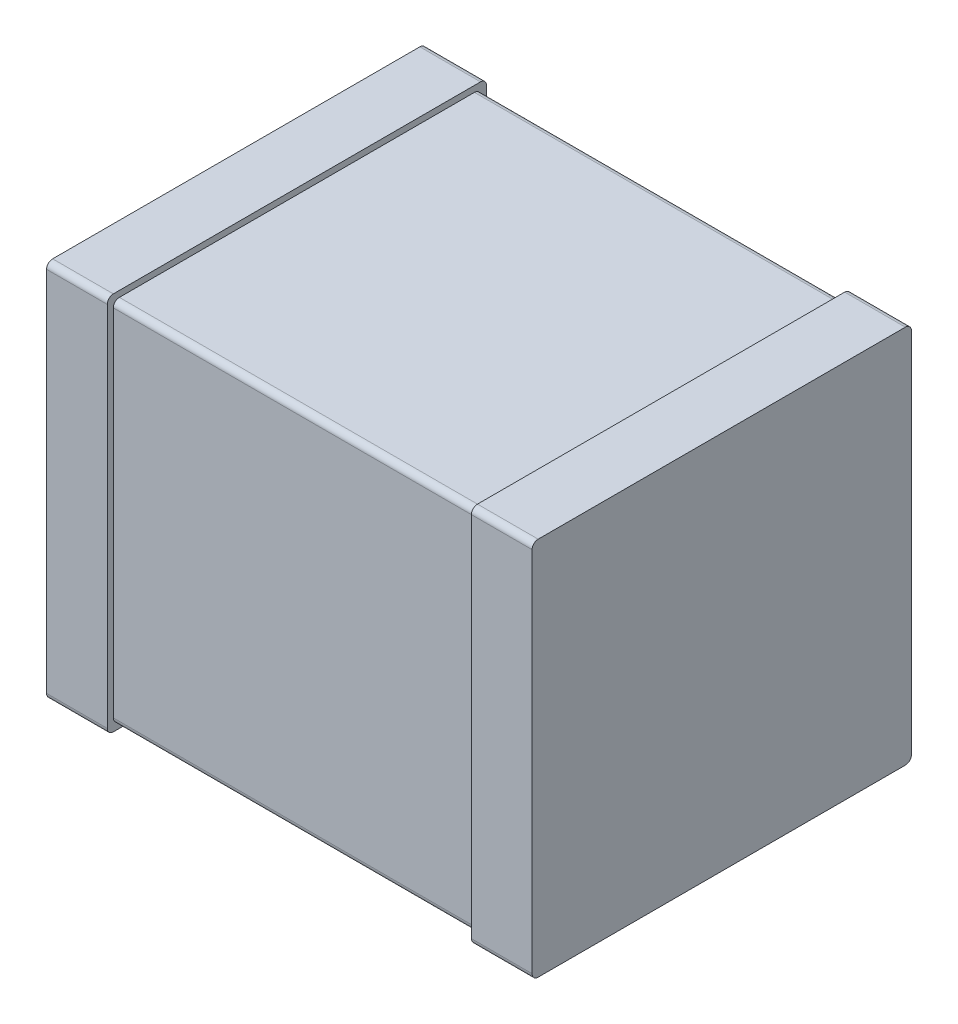
ISO-10303-21;
HEADER;
FILE_DESCRIPTION(('STEP AP214'),'2;1');
FILE_NAME('part.step','',(''),(''),'','','');
FILE_SCHEMA(('AUTOMOTIVE_DESIGN { 1 0 10303 214 1 1 1 1 }'));
ENDSEC;
DATA;
#1=APPLICATION_CONTEXT('core data for automotive mechanical design processes');
#2=APPLICATION_PROTOCOL_DEFINITION('international standard','automotive_design',2000,#1);
#3=PRODUCT_CONTEXT('',#1,'mechanical');
#4=PRODUCT('Part','Part','',(#3));
#5=PRODUCT_RELATED_PRODUCT_CATEGORY('part','',(#4));
#6=PRODUCT_DEFINITION_FORMATION('','',#4);
#7=PRODUCT_DEFINITION_CONTEXT('part definition',#1,'design');
#8=PRODUCT_DEFINITION('design','',#6,#7);
#9=PRODUCT_DEFINITION_SHAPE('','',#8);
#10=(LENGTH_UNIT() NAMED_UNIT(*) SI_UNIT(.MILLI.,.METRE.));
#11=(NAMED_UNIT(*) PLANE_ANGLE_UNIT() SI_UNIT($,.RADIAN.));
#12=(NAMED_UNIT(*) SI_UNIT($,.STERADIAN.) SOLID_ANGLE_UNIT());
#13=UNCERTAINTY_MEASURE_WITH_UNIT(LENGTH_MEASURE(1.E-05),#10,'distance_accuracy_value','');
#14=(GEOMETRIC_REPRESENTATION_CONTEXT(3) GLOBAL_UNCERTAINTY_ASSIGNED_CONTEXT((#13)) GLOBAL_UNIT_ASSIGNED_CONTEXT((#10,
#11,#12)) REPRESENTATION_CONTEXT('',''));
#15=CARTESIAN_POINT('',(0.,0.,0.));
#16=DIRECTION('',(0.,0.,1.));
#17=DIRECTION('',(1.,0.,0.));
#18=AXIS2_PLACEMENT_3D('',#15,#16,#17);
#19=CARTESIAN_POINT('',(1.6,-1.25,0.));
#20=DIRECTION('',(1.,0.,0.));
#21=DIRECTION('',(0.,1.,0.));
#22=AXIS2_PLACEMENT_3D('',#19,#20,#21);
#23=PLANE('',#22);
#24=DIRECTION('',(0.,0.,1.));
#25=VECTOR('',#24,1.);
#26=CARTESIAN_POINT('',(1.6,-1.25,0.));
#27=LINE('',#26,#25);
#28=CARTESIAN_POINT('',(1.6,-1.25,0.04));
#29=VERTEX_POINT('',#28);
#30=CARTESIAN_POINT('',(1.6,-1.25,2.46));
#31=VERTEX_POINT('',#30);
#32=EDGE_CURVE('E385',#29,#31,#27,.T.);
#33=ORIENTED_EDGE('',*,*,#32,.F.);
#34=CARTESIAN_POINT('',(1.6,-1.21,0.04));
#35=DIRECTION('',(1.,0.,0.));
#36=DIRECTION('',(0.,0.,1.));
#37=AXIS2_PLACEMENT_3D('',#34,#35,#36);
#38=CIRCLE('',#37,0.04);
#39=CARTESIAN_POINT('',(1.6,-1.21,0.));
#40=VERTEX_POINT('',#39);
#41=EDGE_CURVE('E483',#29,#40,#38,.T.);
#42=ORIENTED_EDGE('',*,*,#41,.T.);
#43=DIRECTION('',(0.,1.,0.));
#44=VECTOR('',#43,1.);
#45=CARTESIAN_POINT('',(1.6,-1.25,0.));
#46=LINE('',#45,#44);
#47=CARTESIAN_POINT('',(1.6,1.21,0.));
#48=VERTEX_POINT('',#47);
#49=EDGE_CURVE('E492',#40,#48,#46,.T.);
#50=ORIENTED_EDGE('',*,*,#49,.T.);
#51=CARTESIAN_POINT('',(1.6,1.21,0.04));
#52=DIRECTION('',(-1.,0.,0.));
#53=DIRECTION('',(0.,0.,1.));
#54=AXIS2_PLACEMENT_3D('',#51,#52,#53);
#55=CIRCLE('',#54,0.04);
#56=CARTESIAN_POINT('',(1.6,1.25,0.04));
#57=VERTEX_POINT('',#56);
#58=EDGE_CURVE('E20',#57,#48,#55,.T.);
#59=ORIENTED_EDGE('',*,*,#58,.F.);
#60=DIRECTION('',(0.,0.,1.));
#61=VECTOR('',#60,1.);
#62=CARTESIAN_POINT('',(1.6,1.25,0.));
#63=LINE('',#62,#61);
#64=CARTESIAN_POINT('',(1.6,1.25,2.46));
#65=VERTEX_POINT('',#64);
#66=EDGE_CURVE('E11',#57,#65,#63,.T.);
#67=ORIENTED_EDGE('',*,*,#66,.T.);
#68=CARTESIAN_POINT('',(1.6,1.21,2.46));
#69=DIRECTION('',(1.,0.,0.));
#70=DIRECTION('',(0.,0.,1.));
#71=AXIS2_PLACEMENT_3D('',#68,#69,#70);
#72=CIRCLE('',#71,0.04);
#73=CARTESIAN_POINT('',(1.6,1.21,2.5));
#74=VERTEX_POINT('',#73);
#75=EDGE_CURVE('E284',#65,#74,#72,.T.);
#76=ORIENTED_EDGE('',*,*,#75,.T.);
#77=DIRECTION('',(0.,1.,0.));
#78=VECTOR('',#77,1.);
#79=CARTESIAN_POINT('',(1.6,-1.25,2.5));
#80=LINE('',#79,#78);
#81=CARTESIAN_POINT('',(1.6,-1.21,2.5));
#82=VERTEX_POINT('',#81);
#83=EDGE_CURVE('E353',#82,#74,#80,.T.);
#84=ORIENTED_EDGE('',*,*,#83,.F.);
#85=CARTESIAN_POINT('',(1.6,-1.21,2.46));
#86=DIRECTION('',(-1.,0.,0.));
#87=DIRECTION('',(0.,0.,1.));
#88=AXIS2_PLACEMENT_3D('',#85,#86,#87);
#89=CIRCLE('',#88,0.04);
#90=EDGE_CURVE('E487',#31,#82,#89,.T.);
#91=ORIENTED_EDGE('',*,*,#90,.F.);
#92=EDGE_LOOP('',(#33,#42,#50,#59,#67,#76,#84,#91));
#93=FACE_BOUND('',#92,.T.);
#94=ADVANCED_FACE('F17',(#93),#23,.T.);
#95=CARTESIAN_POINT('',(1.2,1.25,0.));
#96=DIRECTION('',(0.,1.,0.));
#97=DIRECTION('',(1.,0.,0.));
#98=AXIS2_PLACEMENT_3D('',#95,#96,#97);
#99=PLANE('',#98);
#100=ORIENTED_EDGE('',*,*,#66,.F.);
#101=DIRECTION('',(1.,0.,0.));
#102=VECTOR('',#101,1.);
#103=CARTESIAN_POINT('',(1.2,1.25,0.04));
#104=LINE('',#103,#102);
#105=CARTESIAN_POINT('',(1.2,1.25,0.04));
#106=VERTEX_POINT('',#105);
#107=EDGE_CURVE('E352',#106,#57,#104,.T.);
#108=ORIENTED_EDGE('',*,*,#107,.F.);
#109=DIRECTION('',(0.,0.,1.));
#110=VECTOR('',#109,1.);
#111=CARTESIAN_POINT('',(1.2,1.25,0.));
#112=LINE('',#111,#110);
#113=CARTESIAN_POINT('',(1.2,1.25,2.46));
#114=VERTEX_POINT('',#113);
#115=EDGE_CURVE('E396',#106,#114,#112,.T.);
#116=ORIENTED_EDGE('',*,*,#115,.T.);
#117=DIRECTION('',(1.,0.,0.));
#118=VECTOR('',#117,1.);
#119=CARTESIAN_POINT('',(1.2,1.25,2.46));
#120=LINE('',#119,#118);
#121=EDGE_CURVE('E26',#114,#65,#120,.T.);
#122=ORIENTED_EDGE('',*,*,#121,.T.);
#123=EDGE_LOOP('',(#100,#108,#116,#122));
#124=FACE_BOUND('',#123,.T.);
#125=ADVANCED_FACE('F523',(#124),#99,.T.);
#126=CARTESIAN_POINT('',(1.2,1.21,2.46));
#127=DIRECTION('',(1.,0.,0.));
#128=DIRECTION('',(0.,1.,0.));
#129=AXIS2_PLACEMENT_3D('',#126,#127,#128);
#130=CYLINDRICAL_SURFACE('',#129,0.04);
#131=CARTESIAN_POINT('',(1.2,1.21,2.46));
#132=DIRECTION('',(1.,0.,0.));
#133=DIRECTION('',(0.,0.,1.));
#134=AXIS2_PLACEMENT_3D('',#131,#132,#133);
#135=CIRCLE('',#134,0.04);
#136=CARTESIAN_POINT('',(1.2,1.21,2.5));
#137=VERTEX_POINT('',#136);
#138=EDGE_CURVE('E461',#114,#137,#135,.T.);
#139=ORIENTED_EDGE('',*,*,#138,.T.);
#140=DIRECTION('',(1.,0.,0.));
#141=VECTOR('',#140,1.);
#142=CARTESIAN_POINT('',(1.2,1.21,2.5));
#143=LINE('',#142,#141);
#144=EDGE_CURVE('E348',#137,#74,#143,.T.);
#145=ORIENTED_EDGE('',*,*,#144,.T.);
#146=ORIENTED_EDGE('',*,*,#75,.F.);
#147=ORIENTED_EDGE('',*,*,#121,.F.);
#148=EDGE_LOOP('',(#139,#145,#146,#147));
#149=FACE_BOUND('',#148,.T.);
#150=ADVANCED_FACE('F526',(#149),#130,.T.);
#151=CARTESIAN_POINT('',(1.2,1.21,0.04));
#152=DIRECTION('',(1.,0.,0.));
#153=DIRECTION('',(0.,1.,0.));
#154=AXIS2_PLACEMENT_3D('',#151,#152,#153);
#155=CYLINDRICAL_SURFACE('',#154,0.04);
#156=ORIENTED_EDGE('',*,*,#107,.T.);
#157=ORIENTED_EDGE('',*,*,#58,.T.);
#158=DIRECTION('',(1.,0.,0.));
#159=VECTOR('',#158,1.);
#160=CARTESIAN_POINT('',(1.2,1.21,0.));
#161=LINE('',#160,#159);
#162=CARTESIAN_POINT('',(1.2,1.21,0.));
#163=VERTEX_POINT('',#162);
#164=EDGE_CURVE('E496',#163,#48,#161,.T.);
#165=ORIENTED_EDGE('',*,*,#164,.F.);
#166=CARTESIAN_POINT('',(1.2,1.21,0.04));
#167=DIRECTION('',(-1.,0.,0.));
#168=DIRECTION('',(0.,0.,1.));
#169=AXIS2_PLACEMENT_3D('',#166,#167,#168);
#170=CIRCLE('',#169,0.04);
#171=EDGE_CURVE('E391',#106,#163,#170,.T.);
#172=ORIENTED_EDGE('',*,*,#171,.F.);
#173=EDGE_LOOP('',(#156,#157,#165,#172));
#174=FACE_BOUND('',#173,.T.);
#175=ADVANCED_FACE('F513',(#174),#155,.T.);
#176=CARTESIAN_POINT('',(1.2,-1.25,2.5));
#177=DIRECTION('',(0.,0.,1.));
#178=DIRECTION('',(1.,0.,0.));
#179=AXIS2_PLACEMENT_3D('',#176,#177,#178);
#180=PLANE('',#179);
#181=DIRECTION('',(0.,1.,0.));
#182=VECTOR('',#181,1.);
#183=CARTESIAN_POINT('',(1.2,-1.25,2.5));
#184=LINE('',#183,#182);
#185=CARTESIAN_POINT('',(1.2,-1.21,2.5));
#186=VERTEX_POINT('',#185);
#187=EDGE_CURVE('E439',#186,#137,#184,.T.);
#188=ORIENTED_EDGE('',*,*,#187,.F.);
#189=DIRECTION('',(1.,0.,0.));
#190=VECTOR('',#189,1.);
#191=CARTESIAN_POINT('',(1.2,-1.21,2.5));
#192=LINE('',#191,#190);
#193=EDGE_CURVE('E491',#186,#82,#192,.T.);
#194=ORIENTED_EDGE('',*,*,#193,.T.);
#195=ORIENTED_EDGE('',*,*,#83,.T.);
#196=ORIENTED_EDGE('',*,*,#144,.F.);
#197=EDGE_LOOP('',(#188,#194,#195,#196));
#198=FACE_BOUND('',#197,.T.);
#199=ADVANCED_FACE('F529',(#198),#180,.T.);
#200=CARTESIAN_POINT('',(1.2,-1.25,0.));
#201=DIRECTION('',(0.,0.,1.));
#202=DIRECTION('',(1.,0.,0.));
#203=AXIS2_PLACEMENT_3D('',#200,#201,#202);
#204=PLANE('',#203);
#205=ORIENTED_EDGE('',*,*,#164,.T.);
#206=ORIENTED_EDGE('',*,*,#49,.F.);
#207=DIRECTION('',(1.,0.,0.));
#208=VECTOR('',#207,1.);
#209=CARTESIAN_POINT('',(1.2,-1.21,0.));
#210=LINE('',#209,#208);
#211=CARTESIAN_POINT('',(1.2,-1.21,0.));
#212=VERTEX_POINT('',#211);
#213=EDGE_CURVE('E389',#212,#40,#210,.T.);
#214=ORIENTED_EDGE('',*,*,#213,.F.);
#215=DIRECTION('',(0.,1.,0.));
#216=VECTOR('',#215,1.);
#217=CARTESIAN_POINT('',(1.2,-1.25,0.));
#218=LINE('',#217,#216);
#219=EDGE_CURVE('E395',#212,#163,#218,.T.);
#220=ORIENTED_EDGE('',*,*,#219,.T.);
#221=EDGE_LOOP('',(#205,#206,#214,#220));
#222=FACE_BOUND('',#221,.T.);
#223=ADVANCED_FACE('F516',(#222),#204,.F.);
#224=CARTESIAN_POINT('',(1.2,-1.21,2.46));
#225=DIRECTION('',(1.,0.,0.));
#226=DIRECTION('',(0.,-1.,0.));
#227=AXIS2_PLACEMENT_3D('',#224,#225,#226);
#228=CYLINDRICAL_SURFACE('',#227,0.04);
#229=DIRECTION('',(1.,0.,0.));
#230=VECTOR('',#229,1.);
#231=CARTESIAN_POINT('',(1.2,-1.25,2.46));
#232=LINE('',#231,#230);
#233=CARTESIAN_POINT('',(1.2,-1.25,2.46));
#234=VERTEX_POINT('',#233);
#235=EDGE_CURVE('E430',#234,#31,#232,.T.);
#236=ORIENTED_EDGE('',*,*,#235,.T.);
#237=ORIENTED_EDGE('',*,*,#90,.T.);
#238=ORIENTED_EDGE('',*,*,#193,.F.);
#239=CARTESIAN_POINT('',(1.2,-1.21,2.46));
#240=DIRECTION('',(-1.,0.,0.));
#241=DIRECTION('',(0.,0.,1.));
#242=AXIS2_PLACEMENT_3D('',#239,#240,#241);
#243=CIRCLE('',#242,0.04);
#244=EDGE_CURVE('E435',#234,#186,#243,.T.);
#245=ORIENTED_EDGE('',*,*,#244,.F.);
#246=EDGE_LOOP('',(#236,#237,#238,#245));
#247=FACE_BOUND('',#246,.T.);
#248=ADVANCED_FACE('F532',(#247),#228,.T.);
#249=CARTESIAN_POINT('',(1.2,-1.21,0.04));
#250=DIRECTION('',(1.,0.,0.));
#251=DIRECTION('',(0.,-1.,0.));
#252=AXIS2_PLACEMENT_3D('',#249,#250,#251);
#253=CYLINDRICAL_SURFACE('',#252,0.04);
#254=CARTESIAN_POINT('',(1.2,-1.21,0.04));
#255=DIRECTION('',(1.,0.,0.));
#256=DIRECTION('',(0.,0.,1.));
#257=AXIS2_PLACEMENT_3D('',#254,#255,#256);
#258=CIRCLE('',#257,0.04);
#259=CARTESIAN_POINT('',(1.2,-1.25,0.04));
#260=VERTEX_POINT('',#259);
#261=EDGE_CURVE('E431',#260,#212,#258,.T.);
#262=ORIENTED_EDGE('',*,*,#261,.T.);
#263=ORIENTED_EDGE('',*,*,#213,.T.);
#264=ORIENTED_EDGE('',*,*,#41,.F.);
#265=DIRECTION('',(1.,0.,0.));
#266=VECTOR('',#265,1.);
#267=CARTESIAN_POINT('',(1.2,-1.25,0.04));
#268=LINE('',#267,#266);
#269=EDGE_CURVE('E390',#260,#29,#268,.T.);
#270=ORIENTED_EDGE('',*,*,#269,.F.);
#271=EDGE_LOOP('',(#262,#263,#264,#270));
#272=FACE_BOUND('',#271,.T.);
#273=ADVANCED_FACE('F537',(#272),#253,.T.);
#274=CARTESIAN_POINT('',(1.2,-1.25,0.));
#275=DIRECTION('',(0.,1.,0.));
#276=DIRECTION('',(1.,0.,0.));
#277=AXIS2_PLACEMENT_3D('',#274,#275,#276);
#278=PLANE('',#277);
#279=ORIENTED_EDGE('',*,*,#235,.F.);
#280=DIRECTION('',(0.,0.,1.));
#281=VECTOR('',#280,1.);
#282=CARTESIAN_POINT('',(1.2,-1.25,0.));
#283=LINE('',#282,#281);
#284=EDGE_CURVE('E426',#260,#234,#283,.T.);
#285=ORIENTED_EDGE('',*,*,#284,.F.);
#286=ORIENTED_EDGE('',*,*,#269,.T.);
#287=ORIENTED_EDGE('',*,*,#32,.T.);
#288=EDGE_LOOP('',(#279,#285,#286,#287));
#289=FACE_BOUND('',#288,.T.);
#290=ADVANCED_FACE('F535',(#289),#278,.F.);
#291=CARTESIAN_POINT('',(1.2,-1.25,0.));
#292=DIRECTION('',(1.,0.,0.));
#293=DIRECTION('',(0.,1.,0.));
#294=AXIS2_PLACEMENT_3D('',#291,#292,#293);
#295=PLANE('',#294);
#296=DIRECTION('',(0.,1.,0.));
#297=VECTOR('',#296,1.);
#298=CARTESIAN_POINT('',(1.2,-1.21,0.04));
#299=LINE('',#298,#297);
#300=CARTESIAN_POINT('',(1.2,-1.17,0.04));
#301=VERTEX_POINT('',#300);
#302=CARTESIAN_POINT('',(1.2,1.17,0.04));
#303=VERTEX_POINT('',#302);
#304=EDGE_CURVE('E419',#301,#303,#299,.T.);
#305=ORIENTED_EDGE('',*,*,#304,.T.);
#306=CARTESIAN_POINT('',(1.2,1.17,0.08));
#307=DIRECTION('',(-1.,0.,0.));
#308=DIRECTION('',(0.,0.,1.));
#309=AXIS2_PLACEMENT_3D('',#306,#307,#308);
#310=CIRCLE('',#309,0.04);
#311=CARTESIAN_POINT('',(1.2,1.21,0.08));
#312=VERTEX_POINT('',#311);
#313=EDGE_CURVE('E273',#312,#303,#310,.T.);
#314=ORIENTED_EDGE('',*,*,#313,.F.);
#315=DIRECTION('',(0.,0.,1.));
#316=VECTOR('',#315,1.);
#317=CARTESIAN_POINT('',(1.2,1.21,0.04));
#318=LINE('',#317,#316);
#319=CARTESIAN_POINT('',(1.2,1.21,2.42));
#320=VERTEX_POINT('',#319);
#321=EDGE_CURVE('E275',#312,#320,#318,.T.);
#322=ORIENTED_EDGE('',*,*,#321,.T.);
#323=CARTESIAN_POINT('',(1.2,1.17,2.42));
#324=DIRECTION('',(1.,0.,0.));
#325=DIRECTION('',(0.,0.,1.));
#326=AXIS2_PLACEMENT_3D('',#323,#324,#325);
#327=CIRCLE('',#326,0.04);
#328=CARTESIAN_POINT('',(1.2,1.17,2.46));
#329=VERTEX_POINT('',#328);
#330=EDGE_CURVE('E321',#320,#329,#327,.T.);
#331=ORIENTED_EDGE('',*,*,#330,.T.);
#332=DIRECTION('',(0.,1.,0.));
#333=VECTOR('',#332,1.);
#334=CARTESIAN_POINT('',(1.2,-1.21,2.46));
#335=LINE('',#334,#333);
#336=CARTESIAN_POINT('',(1.2,-1.17,2.46));
#337=VERTEX_POINT('',#336);
#338=EDGE_CURVE('E320',#337,#329,#335,.T.);
#339=ORIENTED_EDGE('',*,*,#338,.F.);
#340=CARTESIAN_POINT('',(1.2,-1.17,2.42));
#341=DIRECTION('',(-1.,0.,0.));
#342=DIRECTION('',(0.,0.,1.));
#343=AXIS2_PLACEMENT_3D('',#340,#341,#342);
#344=CIRCLE('',#343,0.04);
#345=CARTESIAN_POINT('',(1.2,-1.21,2.42));
#346=VERTEX_POINT('',#345);
#347=EDGE_CURVE('E453',#346,#337,#344,.T.);
#348=ORIENTED_EDGE('',*,*,#347,.F.);
#349=DIRECTION('',(0.,0.,1.));
#350=VECTOR('',#349,1.);
#351=CARTESIAN_POINT('',(1.2,-1.21,0.04));
#352=LINE('',#351,#350);
#353=CARTESIAN_POINT('',(1.2,-1.21,0.08));
#354=VERTEX_POINT('',#353);
#355=EDGE_CURVE('E440',#354,#346,#352,.T.);
#356=ORIENTED_EDGE('',*,*,#355,.F.);
#357=CARTESIAN_POINT('',(1.2,-1.17,0.08));
#358=DIRECTION('',(1.,0.,0.));
#359=DIRECTION('',(0.,0.,1.));
#360=AXIS2_PLACEMENT_3D('',#357,#358,#359);
#361=CIRCLE('',#360,0.04);
#362=EDGE_CURVE('E269',#354,#301,#361,.T.);
#363=ORIENTED_EDGE('',*,*,#362,.T.);
#364=EDGE_LOOP('',(#305,#314,#322,#331,#339,#348,#356,#363));
#365=FACE_BOUND('',#364,.T.);
#366=ORIENTED_EDGE('',*,*,#244,.T.);
#367=ORIENTED_EDGE('',*,*,#187,.T.);
#368=ORIENTED_EDGE('',*,*,#138,.F.);
#369=ORIENTED_EDGE('',*,*,#115,.F.);
#370=ORIENTED_EDGE('',*,*,#171,.T.);
#371=ORIENTED_EDGE('',*,*,#219,.F.);
#372=ORIENTED_EDGE('',*,*,#261,.F.);
#373=ORIENTED_EDGE('',*,*,#284,.T.);
#374=EDGE_LOOP('',(#366,#367,#368,#369,#370,#371,#372,#373));
#375=FACE_BOUND('',#374,.T.);
#376=ADVANCED_FACE('F521',(#365,#375),#295,.F.);
#377=CARTESIAN_POINT('',(-1.2,-1.21,0.04));
#378=DIRECTION('',(0.,1.,0.));
#379=DIRECTION('',(1.,0.,0.));
#380=AXIS2_PLACEMENT_3D('',#377,#378,#379);
#381=PLANE('',#380);
#382=DIRECTION('',(1.,0.,0.));
#383=VECTOR('',#382,1.);
#384=CARTESIAN_POINT('',(-1.2,-1.21,2.42));
#385=LINE('',#384,#383);
#386=CARTESIAN_POINT('',(-1.2,-1.21,2.42));
#387=VERTEX_POINT('',#386);
#388=EDGE_CURVE('E449',#387,#346,#385,.T.);
#389=ORIENTED_EDGE('',*,*,#388,.F.);
#390=DIRECTION('',(0.,0.,1.));
#391=VECTOR('',#390,1.);
#392=CARTESIAN_POINT('',(-1.2,-1.21,0.04));
#393=LINE('',#392,#391);
#394=CARTESIAN_POINT('',(-1.2,-1.21,0.08));
#395=VERTEX_POINT('',#394);
#396=EDGE_CURVE('E364',#395,#387,#393,.T.);
#397=ORIENTED_EDGE('',*,*,#396,.F.);
#398=DIRECTION('',(1.,0.,0.));
#399=VECTOR('',#398,1.);
#400=CARTESIAN_POINT('',(-1.2,-1.21,0.08));
#401=LINE('',#400,#399);
#402=EDGE_CURVE('E412',#395,#354,#401,.T.);
#403=ORIENTED_EDGE('',*,*,#402,.T.);
#404=ORIENTED_EDGE('',*,*,#355,.T.);
#405=EDGE_LOOP('',(#389,#397,#403,#404));
#406=FACE_BOUND('',#405,.T.);
#407=ADVANCED_FACE('F598',(#406),#381,.F.);
#408=CARTESIAN_POINT('',(-1.2,-1.17,2.42));
#409=DIRECTION('',(1.,0.,0.));
#410=DIRECTION('',(0.,-1.,0.));
#411=AXIS2_PLACEMENT_3D('',#408,#409,#410);
#412=CYLINDRICAL_SURFACE('',#411,0.04);
#413=ORIENTED_EDGE('',*,*,#388,.T.);
#414=ORIENTED_EDGE('',*,*,#347,.T.);
#415=DIRECTION('',(1.,0.,0.));
#416=VECTOR('',#415,1.);
#417=CARTESIAN_POINT('',(-1.2,-1.17,2.46));
#418=LINE('',#417,#416);
#419=CARTESIAN_POINT('',(-1.2,-1.17,2.46));
#420=VERTEX_POINT('',#419);
#421=EDGE_CURVE('E316',#420,#337,#418,.T.);
#422=ORIENTED_EDGE('',*,*,#421,.F.);
#423=CARTESIAN_POINT('',(-1.2,-1.17,2.42));
#424=DIRECTION('',(-1.,0.,0.));
#425=DIRECTION('',(0.,0.,1.));
#426=AXIS2_PLACEMENT_3D('',#423,#424,#425);
#427=CIRCLE('',#426,0.04);
#428=EDGE_CURVE('E368',#387,#420,#427,.T.);
#429=ORIENTED_EDGE('',*,*,#428,.F.);
#430=EDGE_LOOP('',(#413,#414,#422,#429));
#431=FACE_BOUND('',#430,.T.);
#432=ADVANCED_FACE('F610',(#431),#412,.T.);
#433=CARTESIAN_POINT('',(-1.2,-1.21,2.46));
#434=DIRECTION('',(0.,0.,1.));
#435=DIRECTION('',(1.,0.,0.));
#436=AXIS2_PLACEMENT_3D('',#433,#434,#435);
#437=PLANE('',#436);
#438=DIRECTION('',(0.,1.,0.));
#439=VECTOR('',#438,1.);
#440=CARTESIAN_POINT('',(-1.2,-1.21,2.46));
#441=LINE('',#440,#439);
#442=CARTESIAN_POINT('',(-1.2,1.17,2.46));
#443=VERTEX_POINT('',#442);
#444=EDGE_CURVE('E372',#420,#443,#441,.T.);
#445=ORIENTED_EDGE('',*,*,#444,.F.);
#446=ORIENTED_EDGE('',*,*,#421,.T.);
#447=ORIENTED_EDGE('',*,*,#338,.T.);
#448=DIRECTION('',(1.,0.,0.));
#449=VECTOR('',#448,1.);
#450=CARTESIAN_POINT('',(-1.2,1.17,2.46));
#451=LINE('',#450,#449);
#452=EDGE_CURVE('E373',#443,#329,#451,.T.);
#453=ORIENTED_EDGE('',*,*,#452,.F.);
#454=EDGE_LOOP('',(#445,#446,#447,#453));
#455=FACE_BOUND('',#454,.T.);
#456=ADVANCED_FACE('F623',(#455),#437,.T.);
#457=CARTESIAN_POINT('',(-1.2,1.17,2.42));
#458=DIRECTION('',(1.,0.,0.));
#459=DIRECTION('',(0.,1.,0.));
#460=AXIS2_PLACEMENT_3D('',#457,#458,#459);
#461=CYLINDRICAL_SURFACE('',#460,0.04);
#462=CARTESIAN_POINT('',(-1.2,1.17,2.42));
#463=DIRECTION('',(1.,0.,0.));
#464=DIRECTION('',(0.,0.,1.));
#465=AXIS2_PLACEMENT_3D('',#462,#463,#464);
#466=CIRCLE('',#465,0.04);
#467=CARTESIAN_POINT('',(-1.2,1.21,2.42));
#468=VERTEX_POINT('',#467);
#469=EDGE_CURVE('E380',#468,#443,#466,.T.);
#470=ORIENTED_EDGE('',*,*,#469,.T.);
#471=ORIENTED_EDGE('',*,*,#452,.T.);
#472=ORIENTED_EDGE('',*,*,#330,.F.);
#473=DIRECTION('',(1.,0.,0.));
#474=VECTOR('',#473,1.);
#475=CARTESIAN_POINT('',(-1.2,1.21,2.42));
#476=LINE('',#475,#474);
#477=EDGE_CURVE('E325',#468,#320,#476,.T.);
#478=ORIENTED_EDGE('',*,*,#477,.F.);
#479=EDGE_LOOP('',(#470,#471,#472,#478));
#480=FACE_BOUND('',#479,.T.);
#481=ADVANCED_FACE('F635',(#480),#461,.T.);
#482=CARTESIAN_POINT('',(-1.2,1.21,0.04));
#483=DIRECTION('',(0.,1.,0.));
#484=DIRECTION('',(1.,0.,0.));
#485=AXIS2_PLACEMENT_3D('',#482,#483,#484);
#486=PLANE('',#485);
#487=ORIENTED_EDGE('',*,*,#321,.F.);
#488=DIRECTION('',(1.,0.,0.));
#489=VECTOR('',#488,1.);
#490=CARTESIAN_POINT('',(-1.2,1.21,0.08));
#491=LINE('',#490,#489);
#492=CARTESIAN_POINT('',(-1.2,1.21,0.08));
#493=VERTEX_POINT('',#492);
#494=EDGE_CURVE('E276',#493,#312,#491,.T.);
#495=ORIENTED_EDGE('',*,*,#494,.F.);
#496=DIRECTION('',(0.,0.,1.));
#497=VECTOR('',#496,1.);
#498=CARTESIAN_POINT('',(-1.2,1.21,0.04));
#499=LINE('',#498,#497);
#500=EDGE_CURVE('E384',#493,#468,#499,.T.);
#501=ORIENTED_EDGE('',*,*,#500,.T.);
#502=ORIENTED_EDGE('',*,*,#477,.T.);
#503=EDGE_LOOP('',(#487,#495,#501,#502));
#504=FACE_BOUND('',#503,.T.);
#505=ADVANCED_FACE('F648',(#504),#486,.T.);
#506=CARTESIAN_POINT('',(-1.2,1.17,0.08));
#507=DIRECTION('',(1.,0.,0.));
#508=DIRECTION('',(0.,1.,0.));
#509=AXIS2_PLACEMENT_3D('',#506,#507,#508);
#510=CYLINDRICAL_SURFACE('',#509,0.04);
#511=ORIENTED_EDGE('',*,*,#494,.T.);
#512=ORIENTED_EDGE('',*,*,#313,.T.);
#513=DIRECTION('',(1.,0.,0.));
#514=VECTOR('',#513,1.);
#515=CARTESIAN_POINT('',(-1.2,1.17,0.04));
#516=LINE('',#515,#514);
#517=CARTESIAN_POINT('',(-1.2,1.17,0.04));
#518=VERTEX_POINT('',#517);
#519=EDGE_CURVE('E416',#518,#303,#516,.T.);
#520=ORIENTED_EDGE('',*,*,#519,.F.);
#521=CARTESIAN_POINT('',(-1.2,1.17,0.08));
#522=DIRECTION('',(-1.,0.,0.));
#523=DIRECTION('',(0.,0.,1.));
#524=AXIS2_PLACEMENT_3D('',#521,#522,#523);
#525=CIRCLE('',#524,0.04);
#526=EDGE_CURVE('E400',#493,#518,#525,.T.);
#527=ORIENTED_EDGE('',*,*,#526,.F.);
#528=EDGE_LOOP('',(#511,#512,#520,#527));
#529=FACE_BOUND('',#528,.T.);
#530=ADVANCED_FACE('F662',(#529),#510,.T.);
#531=CARTESIAN_POINT('',(-1.2,-1.21,0.04));
#532=DIRECTION('',(0.,0.,1.));
#533=DIRECTION('',(1.,0.,0.));
#534=AXIS2_PLACEMENT_3D('',#531,#532,#533);
#535=PLANE('',#534);
#536=ORIENTED_EDGE('',*,*,#519,.T.);
#537=ORIENTED_EDGE('',*,*,#304,.F.);
#538=DIRECTION('',(1.,0.,0.));
#539=VECTOR('',#538,1.);
#540=CARTESIAN_POINT('',(-1.2,-1.17,0.04));
#541=LINE('',#540,#539);
#542=CARTESIAN_POINT('',(-1.2,-1.17,0.04));
#543=VERTEX_POINT('',#542);
#544=EDGE_CURVE('E408',#543,#301,#541,.T.);
#545=ORIENTED_EDGE('',*,*,#544,.F.);
#546=DIRECTION('',(0.,1.,0.));
#547=VECTOR('',#546,1.);
#548=CARTESIAN_POINT('',(-1.2,-1.21,0.04));
#549=LINE('',#548,#547);
#550=EDGE_CURVE('E404',#543,#518,#549,.T.);
#551=ORIENTED_EDGE('',*,*,#550,.T.);
#552=EDGE_LOOP('',(#536,#537,#545,#551));
#553=FACE_BOUND('',#552,.T.);
#554=ADVANCED_FACE('F675',(#553),#535,.F.);
#555=CARTESIAN_POINT('',(-1.2,-1.17,0.08));
#556=DIRECTION('',(1.,0.,0.));
#557=DIRECTION('',(0.,-1.,0.));
#558=AXIS2_PLACEMENT_3D('',#555,#556,#557);
#559=CYLINDRICAL_SURFACE('',#558,0.04);
#560=CARTESIAN_POINT('',(-1.2,-1.17,0.08));
#561=DIRECTION('',(1.,0.,0.));
#562=DIRECTION('',(0.,0.,1.));
#563=AXIS2_PLACEMENT_3D('',#560,#561,#562);
#564=CIRCLE('',#563,0.04);
#565=EDGE_CURVE('E359',#395,#543,#564,.T.);
#566=ORIENTED_EDGE('',*,*,#565,.T.);
#567=ORIENTED_EDGE('',*,*,#544,.T.);
#568=ORIENTED_EDGE('',*,*,#362,.F.);
#569=ORIENTED_EDGE('',*,*,#402,.F.);
#570=EDGE_LOOP('',(#566,#567,#568,#569));
#571=FACE_BOUND('',#570,.T.);
#572=ADVANCED_FACE('F687',(#571),#559,.T.);
#573=CARTESIAN_POINT('',(-1.2,-1.25,0.));
#574=DIRECTION('',(1.,0.,0.));
#575=DIRECTION('',(0.,1.,0.));
#576=AXIS2_PLACEMENT_3D('',#573,#574,#575);
#577=PLANE('',#576);
#578=ORIENTED_EDGE('',*,*,#565,.F.);
#579=ORIENTED_EDGE('',*,*,#396,.T.);
#580=ORIENTED_EDGE('',*,*,#428,.T.);
#581=ORIENTED_EDGE('',*,*,#444,.T.);
#582=ORIENTED_EDGE('',*,*,#469,.F.);
#583=ORIENTED_EDGE('',*,*,#500,.F.);
#584=ORIENTED_EDGE('',*,*,#526,.T.);
#585=ORIENTED_EDGE('',*,*,#550,.F.);
#586=EDGE_LOOP('',(#578,#579,#580,#581,#582,#583,#584,#585));
#587=FACE_BOUND('',#586,.T.);
#588=DIRECTION('',(0.,0.,1.));
#589=VECTOR('',#588,1.);
#590=CARTESIAN_POINT('',(-1.2,-1.25,0.));
#591=LINE('',#590,#589);
#592=CARTESIAN_POINT('',(-1.2,-1.25,0.04));
#593=VERTEX_POINT('',#592);
#594=CARTESIAN_POINT('',(-1.2,-1.25,2.46));
#595=VERTEX_POINT('',#594);
#596=EDGE_CURVE('E237',#593,#595,#591,.T.);
#597=ORIENTED_EDGE('',*,*,#596,.F.);
#598=CARTESIAN_POINT('',(-1.2,-1.21,0.04));
#599=DIRECTION('',(1.,0.,0.));
#600=DIRECTION('',(0.,0.,1.));
#601=AXIS2_PLACEMENT_3D('',#598,#599,#600);
#602=CIRCLE('',#601,0.04);
#603=CARTESIAN_POINT('',(-1.2,-1.21,0.));
#604=VERTEX_POINT('',#603);
#605=EDGE_CURVE('E278',#593,#604,#602,.T.);
#606=ORIENTED_EDGE('',*,*,#605,.T.);
#607=DIRECTION('',(0.,1.,0.));
#608=VECTOR('',#607,1.);
#609=CARTESIAN_POINT('',(-1.2,-1.25,0.));
#610=LINE('',#609,#608);
#611=CARTESIAN_POINT('',(-1.2,1.21,0.));
#612=VERTEX_POINT('',#611);
#613=EDGE_CURVE('E315',#604,#612,#610,.T.);
#614=ORIENTED_EDGE('',*,*,#613,.T.);
#615=CARTESIAN_POINT('',(-1.2,1.21,0.04));
#616=DIRECTION('',(-1.,0.,0.));
#617=DIRECTION('',(0.,0.,1.));
#618=AXIS2_PLACEMENT_3D('',#615,#616,#617);
#619=CIRCLE('',#618,0.04);
#620=CARTESIAN_POINT('',(-1.2,1.25,0.04));
#621=VERTEX_POINT('',#620);
#622=EDGE_CURVE('E341',#621,#612,#619,.T.);
#623=ORIENTED_EDGE('',*,*,#622,.F.);
#624=DIRECTION('',(0.,0.,1.));
#625=VECTOR('',#624,1.);
#626=CARTESIAN_POINT('',(-1.2,1.25,0.));
#627=LINE('',#626,#625);
#628=CARTESIAN_POINT('',(-1.2,1.25,2.46));
#629=VERTEX_POINT('',#628);
#630=EDGE_CURVE('E357',#621,#629,#627,.T.);
#631=ORIENTED_EDGE('',*,*,#630,.T.);
#632=CARTESIAN_POINT('',(-1.2,1.21,2.46));
#633=DIRECTION('',(1.,0.,0.));
#634=DIRECTION('',(0.,0.,1.));
#635=AXIS2_PLACEMENT_3D('',#632,#633,#634);
#636=CIRCLE('',#635,0.04);
#637=CARTESIAN_POINT('',(-1.2,1.21,2.5));
#638=VERTEX_POINT('',#637);
#639=EDGE_CURVE('E344',#629,#638,#636,.T.);
#640=ORIENTED_EDGE('',*,*,#639,.T.);
#641=DIRECTION('',(0.,1.,0.));
#642=VECTOR('',#641,1.);
#643=CARTESIAN_POINT('',(-1.2,-1.25,2.5));
#644=LINE('',#643,#642);
#645=CARTESIAN_POINT('',(-1.2,-1.21,2.5));
#646=VERTEX_POINT('',#645);
#647=EDGE_CURVE('E329',#646,#638,#644,.T.);
#648=ORIENTED_EDGE('',*,*,#647,.F.);
#649=CARTESIAN_POINT('',(-1.2,-1.21,2.46));
#650=DIRECTION('',(-1.,0.,0.));
#651=DIRECTION('',(0.,0.,1.));
#652=AXIS2_PLACEMENT_3D('',#649,#650,#651);
#653=CIRCLE('',#652,0.04);
#654=EDGE_CURVE('E282',#595,#646,#653,.T.);
#655=ORIENTED_EDGE('',*,*,#654,.F.);
#656=EDGE_LOOP('',(#597,#606,#614,#623,#631,#640,#648,#655));
#657=FACE_BOUND('',#656,.T.);
#658=ADVANCED_FACE('F699',(#587,#657),#577,.T.);
#659=CARTESIAN_POINT('',(-1.6,1.25,0.));
#660=DIRECTION('',(0.,1.,0.));
#661=DIRECTION('',(1.,0.,0.));
#662=AXIS2_PLACEMENT_3D('',#659,#660,#661);
#663=PLANE('',#662);
#664=ORIENTED_EDGE('',*,*,#630,.F.);
#665=DIRECTION('',(1.,0.,0.));
#666=VECTOR('',#665,1.);
#667=CARTESIAN_POINT('',(-1.6,1.25,0.04));
#668=LINE('',#667,#666);
#669=CARTESIAN_POINT('',(-1.6,1.25,0.04));
#670=VERTEX_POINT('',#669);
#671=EDGE_CURVE('E337',#670,#621,#668,.T.);
#672=ORIENTED_EDGE('',*,*,#671,.F.);
#673=DIRECTION('',(0.,0.,1.));
#674=VECTOR('',#673,1.);
#675=CARTESIAN_POINT('',(-1.6,1.25,0.));
#676=LINE('',#675,#674);
#677=CARTESIAN_POINT('',(-1.6,1.25,2.46));
#678=VERTEX_POINT('',#677);
#679=EDGE_CURVE('E272',#670,#678,#676,.T.);
#680=ORIENTED_EDGE('',*,*,#679,.T.);
#681=DIRECTION('',(1.,0.,0.));
#682=VECTOR('',#681,1.);
#683=CARTESIAN_POINT('',(-1.6,1.25,2.46));
#684=LINE('',#683,#682);
#685=EDGE_CURVE('E347',#678,#629,#684,.T.);
#686=ORIENTED_EDGE('',*,*,#685,.T.);
#687=EDGE_LOOP('',(#664,#672,#680,#686));
#688=FACE_BOUND('',#687,.T.);
#689=ADVANCED_FACE('F710',(#688),#663,.T.);
#690=CARTESIAN_POINT('',(-1.6,1.21,2.46));
#691=DIRECTION('',(1.,0.,0.));
#692=DIRECTION('',(0.,1.,0.));
#693=AXIS2_PLACEMENT_3D('',#690,#691,#692);
#694=CYLINDRICAL_SURFACE('',#693,0.04);
#695=CARTESIAN_POINT('',(-1.6,1.21,2.46));
#696=DIRECTION('',(1.,0.,0.));
#697=DIRECTION('',(0.,0.,1.));
#698=AXIS2_PLACEMENT_3D('',#695,#696,#697);
#699=CIRCLE('',#698,0.04);
#700=CARTESIAN_POINT('',(-1.6,1.21,2.5));
#701=VERTEX_POINT('',#700);
#702=EDGE_CURVE('E265',#678,#701,#699,.T.);
#703=ORIENTED_EDGE('',*,*,#702,.T.);
#704=DIRECTION('',(1.,0.,0.));
#705=VECTOR('',#704,1.);
#706=CARTESIAN_POINT('',(-1.6,1.21,2.5));
#707=LINE('',#706,#705);
#708=EDGE_CURVE('E333',#701,#638,#707,.T.);
#709=ORIENTED_EDGE('',*,*,#708,.T.);
#710=ORIENTED_EDGE('',*,*,#639,.F.);
#711=ORIENTED_EDGE('',*,*,#685,.F.);
#712=EDGE_LOOP('',(#703,#709,#710,#711));
#713=FACE_BOUND('',#712,.T.);
#714=ADVANCED_FACE('F721',(#713),#694,.T.);
#715=CARTESIAN_POINT('',(-1.6,1.21,0.04));
#716=DIRECTION('',(1.,0.,0.));
#717=DIRECTION('',(0.,1.,0.));
#718=AXIS2_PLACEMENT_3D('',#715,#716,#717);
#719=CYLINDRICAL_SURFACE('',#718,0.04);
#720=ORIENTED_EDGE('',*,*,#671,.T.);
#721=ORIENTED_EDGE('',*,*,#622,.T.);
#722=DIRECTION('',(1.,0.,0.));
#723=VECTOR('',#722,1.);
#724=CARTESIAN_POINT('',(-1.6,1.21,0.));
#725=LINE('',#724,#723);
#726=CARTESIAN_POINT('',(-1.6,1.21,0.));
#727=VERTEX_POINT('',#726);
#728=EDGE_CURVE('E308',#727,#612,#725,.T.);
#729=ORIENTED_EDGE('',*,*,#728,.F.);
#730=CARTESIAN_POINT('',(-1.6,1.21,0.04));
#731=DIRECTION('',(-1.,0.,0.));
#732=DIRECTION('',(0.,0.,1.));
#733=AXIS2_PLACEMENT_3D('',#730,#731,#732);
#734=CIRCLE('',#733,0.04);
#735=EDGE_CURVE('E293',#670,#727,#734,.T.);
#736=ORIENTED_EDGE('',*,*,#735,.F.);
#737=EDGE_LOOP('',(#720,#721,#729,#736));
#738=FACE_BOUND('',#737,.T.);
#739=ADVANCED_FACE('F732',(#738),#719,.T.);
#740=CARTESIAN_POINT('',(-1.6,-1.25,2.5));
#741=DIRECTION('',(0.,0.,1.));
#742=DIRECTION('',(1.,0.,0.));
#743=AXIS2_PLACEMENT_3D('',#740,#741,#742);
#744=PLANE('',#743);
#745=DIRECTION('',(0.,1.,0.));
#746=VECTOR('',#745,1.);
#747=CARTESIAN_POINT('',(-1.6,-1.25,2.5));
#748=LINE('',#747,#746);
#749=CARTESIAN_POINT('',(-1.6,-1.21,2.5));
#750=VERTEX_POINT('',#749);
#751=EDGE_CURVE('E259',#750,#701,#748,.T.);
#752=ORIENTED_EDGE('',*,*,#751,.F.);
#753=DIRECTION('',(1.,0.,0.));
#754=VECTOR('',#753,1.);
#755=CARTESIAN_POINT('',(-1.6,-1.21,2.5));
#756=LINE('',#755,#754);
#757=EDGE_CURVE('E256',#750,#646,#756,.T.);
#758=ORIENTED_EDGE('',*,*,#757,.T.);
#759=ORIENTED_EDGE('',*,*,#647,.T.);
#760=ORIENTED_EDGE('',*,*,#708,.F.);
#761=EDGE_LOOP('',(#752,#758,#759,#760));
#762=FACE_BOUND('',#761,.T.);
#763=ADVANCED_FACE('F743',(#762),#744,.T.);
#764=CARTESIAN_POINT('',(-1.6,-1.25,0.));
#765=DIRECTION('',(0.,0.,1.));
#766=DIRECTION('',(1.,0.,0.));
#767=AXIS2_PLACEMENT_3D('',#764,#765,#766);
#768=PLANE('',#767);
#769=ORIENTED_EDGE('',*,*,#728,.T.);
#770=ORIENTED_EDGE('',*,*,#613,.F.);
#771=DIRECTION('',(1.,0.,0.));
#772=VECTOR('',#771,1.);
#773=CARTESIAN_POINT('',(-1.6,-1.21,0.));
#774=LINE('',#773,#772);
#775=CARTESIAN_POINT('',(-1.6,-1.21,0.));
#776=VERTEX_POINT('',#775);
#777=EDGE_CURVE('E283',#776,#604,#774,.T.);
#778=ORIENTED_EDGE('',*,*,#777,.F.);
#779=DIRECTION('',(0.,1.,0.));
#780=VECTOR('',#779,1.);
#781=CARTESIAN_POINT('',(-1.6,-1.25,0.));
#782=LINE('',#781,#780);
#783=EDGE_CURVE('E298',#776,#727,#782,.T.);
#784=ORIENTED_EDGE('',*,*,#783,.T.);
#785=EDGE_LOOP('',(#769,#770,#778,#784));
#786=FACE_BOUND('',#785,.T.);
#787=ADVANCED_FACE('F755',(#786),#768,.F.);
#788=CARTESIAN_POINT('',(-1.6,-1.21,2.46));
#789=DIRECTION('',(1.,0.,0.));
#790=DIRECTION('',(0.,-1.,0.));
#791=AXIS2_PLACEMENT_3D('',#788,#789,#790);
#792=CYLINDRICAL_SURFACE('',#791,0.04);
#793=DIRECTION('',(1.,0.,0.));
#794=VECTOR('',#793,1.);
#795=CARTESIAN_POINT('',(-1.6,-1.25,2.46));
#796=LINE('',#795,#794);
#797=CARTESIAN_POINT('',(-1.6,-1.25,2.46));
#798=VERTEX_POINT('',#797);
#799=EDGE_CURVE('E230',#798,#595,#796,.T.);
#800=ORIENTED_EDGE('',*,*,#799,.T.);
#801=ORIENTED_EDGE('',*,*,#654,.T.);
#802=ORIENTED_EDGE('',*,*,#757,.F.);
#803=CARTESIAN_POINT('',(-1.6,-1.21,2.46));
#804=DIRECTION('',(-1.,0.,0.));
#805=DIRECTION('',(0.,0.,1.));
#806=AXIS2_PLACEMENT_3D('',#803,#804,#805);
#807=CIRCLE('',#806,0.04);
#808=EDGE_CURVE('E248',#798,#750,#807,.T.);
#809=ORIENTED_EDGE('',*,*,#808,.F.);
#810=EDGE_LOOP('',(#800,#801,#802,#809));
#811=FACE_BOUND('',#810,.T.);
#812=ADVANCED_FACE('F254',(#811),#792,.T.);
#813=CARTESIAN_POINT('',(-1.6,-1.21,0.04));
#814=DIRECTION('',(1.,0.,0.));
#815=DIRECTION('',(0.,-1.,0.));
#816=AXIS2_PLACEMENT_3D('',#813,#814,#815);
#817=CYLINDRICAL_SURFACE('',#816,0.04);
#818=CARTESIAN_POINT('',(-1.6,-1.21,0.04));
#819=DIRECTION('',(1.,0.,0.));
#820=DIRECTION('',(0.,0.,1.));
#821=AXIS2_PLACEMENT_3D('',#818,#819,#820);
#822=CIRCLE('',#821,0.04);
#823=CARTESIAN_POINT('',(-1.6,-1.25,0.04));
#824=VERTEX_POINT('',#823);
#825=EDGE_CURVE('E251',#824,#776,#822,.T.);
#826=ORIENTED_EDGE('',*,*,#825,.T.);
#827=ORIENTED_EDGE('',*,*,#777,.T.);
#828=ORIENTED_EDGE('',*,*,#605,.F.);
#829=DIRECTION('',(1.,0.,0.));
#830=VECTOR('',#829,1.);
#831=CARTESIAN_POINT('',(-1.6,-1.25,0.04));
#832=LINE('',#831,#830);
#833=EDGE_CURVE('E242',#824,#593,#832,.T.);
#834=ORIENTED_EDGE('',*,*,#833,.F.);
#835=EDGE_LOOP('',(#826,#827,#828,#834));
#836=FACE_BOUND('',#835,.T.);
#837=ADVANCED_FACE('F774',(#836),#817,.T.);
#838=CARTESIAN_POINT('',(-1.6,-1.25,0.));
#839=DIRECTION('',(0.,1.,0.));
#840=DIRECTION('',(1.,0.,0.));
#841=AXIS2_PLACEMENT_3D('',#838,#839,#840);
#842=PLANE('',#841);
#843=ORIENTED_EDGE('',*,*,#799,.F.);
#844=DIRECTION('',(0.,0.,1.));
#845=VECTOR('',#844,1.);
#846=CARTESIAN_POINT('',(-1.6,-1.25,0.));
#847=LINE('',#846,#845);
#848=EDGE_CURVE('E234',#824,#798,#847,.T.);
#849=ORIENTED_EDGE('',*,*,#848,.F.);
#850=ORIENTED_EDGE('',*,*,#833,.T.);
#851=ORIENTED_EDGE('',*,*,#596,.T.);
#852=EDGE_LOOP('',(#843,#849,#850,#851));
#853=FACE_BOUND('',#852,.T.);
#854=ADVANCED_FACE('F232',(#853),#842,.F.);
#855=CARTESIAN_POINT('',(-1.6,-1.25,0.));
#856=DIRECTION('',(1.,0.,0.));
#857=DIRECTION('',(0.,1.,0.));
#858=AXIS2_PLACEMENT_3D('',#855,#856,#857);
#859=PLANE('',#858);
#860=ORIENTED_EDGE('',*,*,#808,.T.);
#861=ORIENTED_EDGE('',*,*,#751,.T.);
#862=ORIENTED_EDGE('',*,*,#702,.F.);
#863=ORIENTED_EDGE('',*,*,#679,.F.);
#864=ORIENTED_EDGE('',*,*,#735,.T.);
#865=ORIENTED_EDGE('',*,*,#783,.F.);
#866=ORIENTED_EDGE('',*,*,#825,.F.);
#867=ORIENTED_EDGE('',*,*,#848,.T.);
#868=EDGE_LOOP('',(#860,#861,#862,#863,#864,#865,#866,#867));
#869=FACE_BOUND('',#868,.T.);
#870=ADVANCED_FACE('F246',(#869),#859,.F.);
#871=CLOSED_SHELL('',(#94,#125,#150,#175,#199,#223,#248,#273,#290,#376,#407,#432,#456,#481,#505,
#530,#554,#572,#658,#689,#714,#739,#763,#787,#812,#837,#854,#870));
#872=MANIFOLD_SOLID_BREP('B1',#871);
#873=ADVANCED_BREP_SHAPE_REPRESENTATION('',(#18,#872),#14);
#874=SHAPE_DEFINITION_REPRESENTATION(#9,#873);
ENDSEC;
END-ISO-10303-21;
